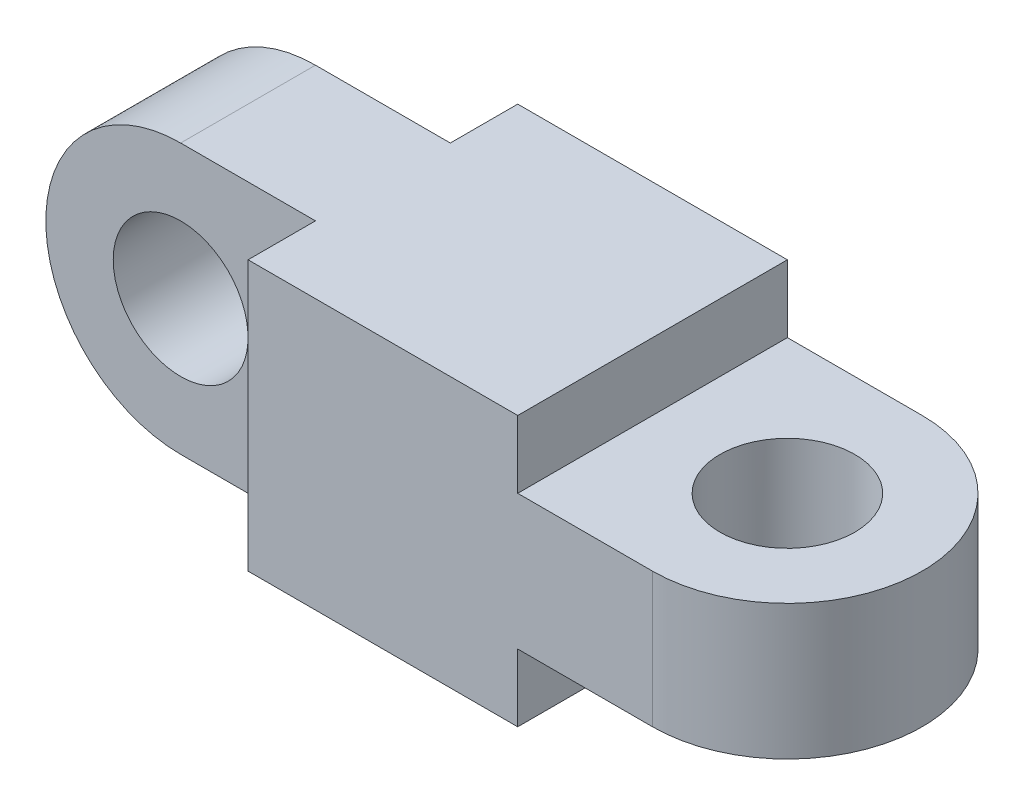
ISO-10303-21;
HEADER;
FILE_DESCRIPTION(('STEP AP214'),'2;1');
FILE_NAME('part.step','',(''),(''),'','','');
FILE_SCHEMA(('AUTOMOTIVE_DESIGN { 1 0 10303 214 1 1 1 1 }'));
ENDSEC;
DATA;
#1=APPLICATION_CONTEXT('core data for automotive mechanical design processes');
#2=APPLICATION_PROTOCOL_DEFINITION('international standard','automotive_design',2000,#1);
#3=PRODUCT_CONTEXT('',#1,'mechanical');
#4=PRODUCT('Part','Part','',(#3));
#5=PRODUCT_RELATED_PRODUCT_CATEGORY('part','',(#4));
#6=PRODUCT_DEFINITION_FORMATION('','',#4);
#7=PRODUCT_DEFINITION_CONTEXT('part definition',#1,'design');
#8=PRODUCT_DEFINITION('design','',#6,#7);
#9=PRODUCT_DEFINITION_SHAPE('','',#8);
#10=(LENGTH_UNIT() NAMED_UNIT(*) SI_UNIT(.MILLI.,.METRE.));
#11=(NAMED_UNIT(*) PLANE_ANGLE_UNIT() SI_UNIT($,.RADIAN.));
#12=(NAMED_UNIT(*) SI_UNIT($,.STERADIAN.) SOLID_ANGLE_UNIT());
#13=UNCERTAINTY_MEASURE_WITH_UNIT(LENGTH_MEASURE(1.E-05),#10,'distance_accuracy_value','');
#14=(GEOMETRIC_REPRESENTATION_CONTEXT(3) GLOBAL_UNCERTAINTY_ASSIGNED_CONTEXT((#13)) GLOBAL_UNIT_ASSIGNED_CONTEXT((#10,
#11,#12)) REPRESENTATION_CONTEXT('',''));
#15=CARTESIAN_POINT('',(0.,0.,0.));
#16=DIRECTION('',(0.,0.,1.));
#17=DIRECTION('',(1.,0.,0.));
#18=AXIS2_PLACEMENT_3D('',#15,#16,#17);
#19=CARTESIAN_POINT('',(40.,20.,10.));
#20=DIRECTION('',(0.,-1.,0.));
#21=DIRECTION('',(0.,0.,-1.));
#22=AXIS2_PLACEMENT_3D('',#19,#20,#21);
#23=PLANE('',#22);
#24=DIRECTION('',(-1.,0.,0.));
#25=VECTOR('',#24,1.);
#26=CARTESIAN_POINT('',(-10.,20.,5.));
#27=LINE('',#26,#25);
#28=CARTESIAN_POINT('',(10.,20.,5.));
#29=VERTEX_POINT('',#28);
#30=CARTESIAN_POINT('',(0.,20.,5.));
#31=VERTEX_POINT('',#30);
#32=EDGE_CURVE('E219',#29,#31,#27,.T.);
#33=ORIENTED_EDGE('',*,*,#32,.T.);
#34=DIRECTION('',(0.,0.,-1.));
#35=VECTOR('',#34,1.);
#36=CARTESIAN_POINT('',(0.,20.,20.));
#37=LINE('',#36,#35);
#38=CARTESIAN_POINT('',(0.,20.,15.));
#39=VERTEX_POINT('',#38);
#40=EDGE_CURVE('E232',#39,#31,#37,.T.);
#41=ORIENTED_EDGE('',*,*,#40,.F.);
#42=DIRECTION('',(1.,0.,0.));
#43=VECTOR('',#42,1.);
#44=CARTESIAN_POINT('',(-10.,20.,15.));
#45=LINE('',#44,#43);
#46=CARTESIAN_POINT('',(10.,20.,15.));
#47=VERTEX_POINT('',#46);
#48=EDGE_CURVE('E198',#39,#47,#45,.T.);
#49=ORIENTED_EDGE('',*,*,#48,.T.);
#50=DIRECTION('',(0.,0.,1.));
#51=VECTOR('',#50,1.);
#52=CARTESIAN_POINT('',(10.,20.,15.));
#53=LINE('',#52,#51);
#54=CARTESIAN_POINT('',(10.,20.,20.));
#55=VERTEX_POINT('',#54);
#56=EDGE_CURVE('E216',#47,#55,#53,.T.);
#57=ORIENTED_EDGE('',*,*,#56,.T.);
#58=DIRECTION('',(1.,0.,0.));
#59=VECTOR('',#58,1.);
#60=CARTESIAN_POINT('',(40.,20.,20.));
#61=LINE('',#60,#59);
#62=CARTESIAN_POINT('',(30.,20.,20.));
#63=VERTEX_POINT('',#62);
#64=EDGE_CURVE('E169',#55,#63,#61,.T.);
#65=ORIENTED_EDGE('',*,*,#64,.T.);
#66=DIRECTION('',(0.,0.,-1.));
#67=VECTOR('',#66,1.);
#68=CARTESIAN_POINT('',(30.,20.,20.));
#69=LINE('',#68,#67);
#70=CARTESIAN_POINT('',(30.,20.,0.));
#71=VERTEX_POINT('',#70);
#72=EDGE_CURVE('E54',#63,#71,#69,.T.);
#73=ORIENTED_EDGE('',*,*,#72,.T.);
#74=DIRECTION('',(-1.,0.,0.));
#75=VECTOR('',#74,1.);
#76=CARTESIAN_POINT('',(40.,20.,0.));
#77=LINE('',#76,#75);
#78=CARTESIAN_POINT('',(10.,20.,0.));
#79=VERTEX_POINT('',#78);
#80=EDGE_CURVE('E157',#71,#79,#77,.T.);
#81=ORIENTED_EDGE('',*,*,#80,.T.);
#82=DIRECTION('',(0.,0.,1.));
#83=VECTOR('',#82,1.);
#84=CARTESIAN_POINT('',(10.,20.,5.));
#85=LINE('',#84,#83);
#86=EDGE_CURVE('E160',#79,#29,#85,.T.);
#87=ORIENTED_EDGE('',*,*,#86,.T.);
#88=EDGE_LOOP('',(#33,#41,#49,#57,#65,#73,#81,#87));
#89=FACE_BOUND('',#88,.T.);
#90=ADVANCED_FACE('F38',(#89),#23,.F.);
#91=CARTESIAN_POINT('',(40.,0.,10.));
#92=DIRECTION('',(0.,-1.,0.));
#93=DIRECTION('',(0.,0.,-1.));
#94=AXIS2_PLACEMENT_3D('',#91,#92,#93);
#95=PLANE('',#94);
#96=DIRECTION('',(0.,0.,-1.));
#97=VECTOR('',#96,1.);
#98=CARTESIAN_POINT('',(0.,0.,20.));
#99=LINE('',#98,#97);
#100=CARTESIAN_POINT('',(0.,0.,15.));
#101=VERTEX_POINT('',#100);
#102=CARTESIAN_POINT('',(0.,0.,5.));
#103=VERTEX_POINT('',#102);
#104=EDGE_CURVE('E150',#101,#103,#99,.T.);
#105=ORIENTED_EDGE('',*,*,#104,.T.);
#106=DIRECTION('',(-1.,0.,0.));
#107=VECTOR('',#106,1.);
#108=CARTESIAN_POINT('',(-10.,0.,5.));
#109=LINE('',#108,#107);
#110=CARTESIAN_POINT('',(10.,0.,5.));
#111=VERTEX_POINT('',#110);
#112=EDGE_CURVE('E208',#111,#103,#109,.T.);
#113=ORIENTED_EDGE('',*,*,#112,.F.);
#114=DIRECTION('',(0.,0.,1.));
#115=VECTOR('',#114,1.);
#116=CARTESIAN_POINT('',(10.,0.,5.));
#117=LINE('',#116,#115);
#118=CARTESIAN_POINT('',(10.,0.,0.));
#119=VERTEX_POINT('',#118);
#120=EDGE_CURVE('E209',#119,#111,#117,.T.);
#121=ORIENTED_EDGE('',*,*,#120,.F.);
#122=DIRECTION('',(-1.,0.,0.));
#123=VECTOR('',#122,1.);
#124=CARTESIAN_POINT('',(40.,0.,0.));
#125=LINE('',#124,#123);
#126=CARTESIAN_POINT('',(30.,0.,0.));
#127=VERTEX_POINT('',#126);
#128=EDGE_CURVE('E149',#127,#119,#125,.T.);
#129=ORIENTED_EDGE('',*,*,#128,.F.);
#130=DIRECTION('',(0.,0.,-1.));
#131=VECTOR('',#130,1.);
#132=CARTESIAN_POINT('',(30.,0.,20.));
#133=LINE('',#132,#131);
#134=CARTESIAN_POINT('',(30.,0.,20.));
#135=VERTEX_POINT('',#134);
#136=EDGE_CURVE('E132',#135,#127,#133,.T.);
#137=ORIENTED_EDGE('',*,*,#136,.F.);
#138=DIRECTION('',(1.,0.,0.));
#139=VECTOR('',#138,1.);
#140=CARTESIAN_POINT('',(40.,0.,20.));
#141=LINE('',#140,#139);
#142=CARTESIAN_POINT('',(10.,0.,20.));
#143=VERTEX_POINT('',#142);
#144=EDGE_CURVE('E147',#143,#135,#141,.T.);
#145=ORIENTED_EDGE('',*,*,#144,.F.);
#146=DIRECTION('',(0.,0.,1.));
#147=VECTOR('',#146,1.);
#148=CARTESIAN_POINT('',(10.,0.,15.));
#149=LINE('',#148,#147);
#150=CARTESIAN_POINT('',(10.,0.,15.));
#151=VERTEX_POINT('',#150);
#152=EDGE_CURVE('E158',#151,#143,#149,.T.);
#153=ORIENTED_EDGE('',*,*,#152,.F.);
#154=DIRECTION('',(1.,0.,0.));
#155=VECTOR('',#154,1.);
#156=CARTESIAN_POINT('',(-10.,0.,15.));
#157=LINE('',#156,#155);
#158=EDGE_CURVE('E162',#101,#151,#157,.T.);
#159=ORIENTED_EDGE('',*,*,#158,.F.);
#160=EDGE_LOOP('',(#105,#113,#121,#129,#137,#145,#153,#159));
#161=FACE_BOUND('',#160,.T.);
#162=ADVANCED_FACE('F145',(#161),#95,.T.);
#163=CARTESIAN_POINT('',(40.,20.,10.));
#164=DIRECTION('',(0.,-1.,0.));
#165=DIRECTION('',(0.,0.,-1.));
#166=AXIS2_PLACEMENT_3D('',#163,#164,#165);
#167=CYLINDRICAL_SURFACE('',#166,10.);
#168=DIRECTION('',(0.,-1.,0.));
#169=VECTOR('',#168,1.);
#170=CARTESIAN_POINT('',(40.,20.,0.));
#171=LINE('',#170,#169);
#172=CARTESIAN_POINT('',(40.,15.,0.));
#173=VERTEX_POINT('',#172);
#174=CARTESIAN_POINT('',(40.,5.00000000000001,0.));
#175=VERTEX_POINT('',#174);
#176=EDGE_CURVE('E180',#173,#175,#171,.T.);
#177=ORIENTED_EDGE('',*,*,#176,.F.);
#178=CARTESIAN_POINT('',(40.,15.,10.));
#179=DIRECTION('',(0.,-1.,0.));
#180=DIRECTION('',(1.,0.,0.));
#181=AXIS2_PLACEMENT_3D('',#178,#179,#180);
#182=CIRCLE('',#181,10.);
#183=CARTESIAN_POINT('',(40.,15.,20.));
#184=VERTEX_POINT('',#183);
#185=EDGE_CURVE('E206',#173,#184,#182,.T.);
#186=ORIENTED_EDGE('',*,*,#185,.T.);
#187=DIRECTION('',(0.,-1.,0.));
#188=VECTOR('',#187,1.);
#189=CARTESIAN_POINT('',(40.,20.,20.));
#190=LINE('',#189,#188);
#191=CARTESIAN_POINT('',(40.,5.,20.));
#192=VERTEX_POINT('',#191);
#193=EDGE_CURVE('E166',#184,#192,#190,.T.);
#194=ORIENTED_EDGE('',*,*,#193,.T.);
#195=CARTESIAN_POINT('',(40.,5.00000000000001,10.));
#196=DIRECTION('',(0.,1.,0.));
#197=DIRECTION('',(-1.,0.,0.));
#198=AXIS2_PLACEMENT_3D('',#195,#196,#197);
#199=CIRCLE('',#198,10.);
#200=EDGE_CURVE('E62',#192,#175,#199,.T.);
#201=ORIENTED_EDGE('',*,*,#200,.T.);
#202=EDGE_LOOP('',(#177,#186,#194,#201));
#203=FACE_BOUND('',#202,.T.);
#204=ADVANCED_FACE('F40',(#203),#167,.T.);
#205=CARTESIAN_POINT('',(40.,20.,0.));
#206=DIRECTION('',(0.,0.,1.));
#207=DIRECTION('',(1.,0.,0.));
#208=AXIS2_PLACEMENT_3D('',#205,#206,#207);
#209=PLANE('',#208);
#210=DIRECTION('',(1.,0.,0.));
#211=VECTOR('',#210,1.);
#212=CARTESIAN_POINT('',(50.,5.00000000000001,0.));
#213=LINE('',#212,#211);
#214=CARTESIAN_POINT('',(30.,5.00000000000001,0.));
#215=VERTEX_POINT('',#214);
#216=EDGE_CURVE('E238',#215,#175,#213,.T.);
#217=ORIENTED_EDGE('',*,*,#216,.F.);
#218=DIRECTION('',(0.,1.,0.));
#219=VECTOR('',#218,1.);
#220=CARTESIAN_POINT('',(30.,5.00000000000001,0.));
#221=LINE('',#220,#219);
#222=EDGE_CURVE('E240',#127,#215,#221,.T.);
#223=ORIENTED_EDGE('',*,*,#222,.F.);
#224=ORIENTED_EDGE('',*,*,#128,.T.);
#225=DIRECTION('',(0.,-1.,0.));
#226=VECTOR('',#225,1.);
#227=CARTESIAN_POINT('',(10.,20.,0.));
#228=LINE('',#227,#226);
#229=EDGE_CURVE('E177',#79,#119,#228,.T.);
#230=ORIENTED_EDGE('',*,*,#229,.F.);
#231=ORIENTED_EDGE('',*,*,#80,.F.);
#232=DIRECTION('',(0.,1.,0.));
#233=VECTOR('',#232,1.);
#234=CARTESIAN_POINT('',(30.,15.,0.));
#235=LINE('',#234,#233);
#236=CARTESIAN_POINT('',(30.,15.,0.));
#237=VERTEX_POINT('',#236);
#238=EDGE_CURVE('E139',#237,#71,#235,.T.);
#239=ORIENTED_EDGE('',*,*,#238,.F.);
#240=DIRECTION('',(-1.,0.,0.));
#241=VECTOR('',#240,1.);
#242=CARTESIAN_POINT('',(50.,15.,0.));
#243=LINE('',#242,#241);
#244=EDGE_CURVE('E236',#173,#237,#243,.T.);
#245=ORIENTED_EDGE('',*,*,#244,.F.);
#246=ORIENTED_EDGE('',*,*,#176,.T.);
#247=EDGE_LOOP('',(#217,#223,#224,#230,#231,#239,#245,#246));
#248=FACE_BOUND('',#247,.T.);
#249=ADVANCED_FACE('F255',(#248),#209,.F.);
#250=CARTESIAN_POINT('',(-10.,20.,5.));
#251=DIRECTION('',(0.,0.,1.));
#252=DIRECTION('',(1.,0.,0.));
#253=AXIS2_PLACEMENT_3D('',#250,#251,#252);
#254=PLANE('',#253);
#255=CARTESIAN_POINT('',(0.,10.,5.));
#256=DIRECTION('',(0.,0.,1.));
#257=DIRECTION('',(1.,0.,0.));
#258=AXIS2_PLACEMENT_3D('',#255,#256,#257);
#259=CIRCLE('',#258,5.);
#260=CARTESIAN_POINT('',(5.,10.,5.));
#261=VERTEX_POINT('',#260);
#262=EDGE_CURVE('E11',#261,#261,#259,.F.);
#263=ORIENTED_EDGE('',*,*,#262,.F.);
#264=EDGE_LOOP('',(#263));
#265=FACE_BOUND('',#264,.T.);
#266=ORIENTED_EDGE('',*,*,#112,.T.);
#267=CARTESIAN_POINT('',(0.,10.,5.));
#268=DIRECTION('',(0.,0.,1.));
#269=DIRECTION('',(1.,0.,0.));
#270=AXIS2_PLACEMENT_3D('',#267,#268,#269);
#271=CIRCLE('',#270,10.);
#272=EDGE_CURVE('E203',#103,#31,#271,.F.);
#273=ORIENTED_EDGE('',*,*,#272,.T.);
#274=ORIENTED_EDGE('',*,*,#32,.F.);
#275=DIRECTION('',(0.,-1.,0.));
#276=VECTOR('',#275,1.);
#277=CARTESIAN_POINT('',(10.,20.,5.));
#278=LINE('',#277,#276);
#279=EDGE_CURVE('E174',#29,#111,#278,.T.);
#280=ORIENTED_EDGE('',*,*,#279,.T.);
#281=EDGE_LOOP('',(#266,#273,#274,#280));
#282=FACE_BOUND('',#281,.T.);
#283=ADVANCED_FACE('F289',(#265,#282),#254,.F.);
#284=CARTESIAN_POINT('',(-10.,20.,15.));
#285=DIRECTION('',(0.,0.,-1.));
#286=DIRECTION('',(-1.,0.,0.));
#287=AXIS2_PLACEMENT_3D('',#284,#285,#286);
#288=PLANE('',#287);
#289=CARTESIAN_POINT('',(0.,10.,15.));
#290=DIRECTION('',(0.,0.,-1.));
#291=DIRECTION('',(-1.,0.,0.));
#292=AXIS2_PLACEMENT_3D('',#289,#290,#291);
#293=CIRCLE('',#292,5.);
#294=CARTESIAN_POINT('',(-5.,10.,15.));
#295=VERTEX_POINT('',#294);
#296=EDGE_CURVE('E188',#295,#295,#293,.F.);
#297=ORIENTED_EDGE('',*,*,#296,.F.);
#298=EDGE_LOOP('',(#297));
#299=FACE_BOUND('',#298,.T.);
#300=CARTESIAN_POINT('',(0.,10.,15.));
#301=DIRECTION('',(0.,0.,-1.));
#302=DIRECTION('',(-1.,0.,0.));
#303=AXIS2_PLACEMENT_3D('',#300,#301,#302);
#304=CIRCLE('',#303,10.);
#305=EDGE_CURVE('E42',#39,#101,#304,.F.);
#306=ORIENTED_EDGE('',*,*,#305,.T.);
#307=ORIENTED_EDGE('',*,*,#158,.T.);
#308=DIRECTION('',(0.,-1.,0.));
#309=VECTOR('',#308,1.);
#310=CARTESIAN_POINT('',(10.,20.,15.));
#311=LINE('',#310,#309);
#312=EDGE_CURVE('E171',#47,#151,#311,.T.);
#313=ORIENTED_EDGE('',*,*,#312,.F.);
#314=ORIENTED_EDGE('',*,*,#48,.F.);
#315=EDGE_LOOP('',(#306,#307,#313,#314));
#316=FACE_BOUND('',#315,.T.);
#317=ADVANCED_FACE('F195',(#299,#316),#288,.F.);
#318=CARTESIAN_POINT('',(40.,20.,20.));
#319=DIRECTION('',(0.,0.,-1.));
#320=DIRECTION('',(-1.,0.,0.));
#321=AXIS2_PLACEMENT_3D('',#318,#319,#320);
#322=PLANE('',#321);
#323=ORIENTED_EDGE('',*,*,#144,.T.);
#324=DIRECTION('',(0.,1.,0.));
#325=VECTOR('',#324,1.);
#326=CARTESIAN_POINT('',(30.,5.00000000000001,20.));
#327=LINE('',#326,#325);
#328=CARTESIAN_POINT('',(30.,5.00000000000001,20.));
#329=VERTEX_POINT('',#328);
#330=EDGE_CURVE('E129',#135,#329,#327,.T.);
#331=ORIENTED_EDGE('',*,*,#330,.T.);
#332=DIRECTION('',(1.,0.,0.));
#333=VECTOR('',#332,1.);
#334=CARTESIAN_POINT('',(50.,5.00000000000001,20.));
#335=LINE('',#334,#333);
#336=EDGE_CURVE('E138',#329,#192,#335,.T.);
#337=ORIENTED_EDGE('',*,*,#336,.T.);
#338=ORIENTED_EDGE('',*,*,#193,.F.);
#339=DIRECTION('',(-1.,0.,0.));
#340=VECTOR('',#339,1.);
#341=CARTESIAN_POINT('',(50.,15.,20.));
#342=LINE('',#341,#340);
#343=CARTESIAN_POINT('',(30.,15.,20.));
#344=VERTEX_POINT('',#343);
#345=EDGE_CURVE('E243',#184,#344,#342,.T.);
#346=ORIENTED_EDGE('',*,*,#345,.T.);
#347=DIRECTION('',(0.,1.,0.));
#348=VECTOR('',#347,1.);
#349=CARTESIAN_POINT('',(30.,15.,20.));
#350=LINE('',#349,#348);
#351=EDGE_CURVE('E234',#344,#63,#350,.T.);
#352=ORIENTED_EDGE('',*,*,#351,.T.);
#353=ORIENTED_EDGE('',*,*,#64,.F.);
#354=DIRECTION('',(0.,-1.,0.));
#355=VECTOR('',#354,1.);
#356=CARTESIAN_POINT('',(10.,20.,20.));
#357=LINE('',#356,#355);
#358=EDGE_CURVE('E156',#55,#143,#357,.T.);
#359=ORIENTED_EDGE('',*,*,#358,.T.);
#360=EDGE_LOOP('',(#323,#331,#337,#338,#346,#352,#353,#359));
#361=FACE_BOUND('',#360,.T.);
#362=ADVANCED_FACE('F153',(#361),#322,.F.);
#363=CARTESIAN_POINT('',(10.,20.,5.));
#364=DIRECTION('',(1.,0.,0.));
#365=DIRECTION('',(0.,0.,-1.));
#366=AXIS2_PLACEMENT_3D('',#363,#364,#365);
#367=PLANE('',#366);
#368=ORIENTED_EDGE('',*,*,#120,.T.);
#369=ORIENTED_EDGE('',*,*,#279,.F.);
#370=ORIENTED_EDGE('',*,*,#86,.F.);
#371=ORIENTED_EDGE('',*,*,#229,.T.);
#372=EDGE_LOOP('',(#368,#369,#370,#371));
#373=FACE_BOUND('',#372,.T.);
#374=ADVANCED_FACE('F264',(#373),#367,.F.);
#375=CARTESIAN_POINT('',(10.,20.,15.));
#376=DIRECTION('',(1.,0.,0.));
#377=DIRECTION('',(0.,0.,-1.));
#378=AXIS2_PLACEMENT_3D('',#375,#376,#377);
#379=PLANE('',#378);
#380=ORIENTED_EDGE('',*,*,#152,.T.);
#381=ORIENTED_EDGE('',*,*,#358,.F.);
#382=ORIENTED_EDGE('',*,*,#56,.F.);
#383=ORIENTED_EDGE('',*,*,#312,.T.);
#384=EDGE_LOOP('',(#380,#381,#382,#383));
#385=FACE_BOUND('',#384,.T.);
#386=ADVANCED_FACE('F262',(#385),#379,.F.);
#387=CARTESIAN_POINT('',(50.,15.,20.));
#388=DIRECTION('',(0.,-1.,0.));
#389=DIRECTION('',(1.,0.,0.));
#390=AXIS2_PLACEMENT_3D('',#387,#388,#389);
#391=PLANE('',#390);
#392=CARTESIAN_POINT('',(40.,15.,10.));
#393=DIRECTION('',(0.,-1.,0.));
#394=DIRECTION('',(1.,0.,0.));
#395=AXIS2_PLACEMENT_3D('',#392,#393,#394);
#396=CIRCLE('',#395,5.00000000000001);
#397=CARTESIAN_POINT('',(45.,15.,10.));
#398=VERTEX_POINT('',#397);
#399=EDGE_CURVE('E183',#398,#398,#396,.T.);
#400=ORIENTED_EDGE('',*,*,#399,.T.);
#401=EDGE_LOOP('',(#400));
#402=FACE_BOUND('',#401,.T.);
#403=ORIENTED_EDGE('',*,*,#185,.F.);
#404=ORIENTED_EDGE('',*,*,#244,.T.);
#405=DIRECTION('',(0.,0.,-1.));
#406=VECTOR('',#405,1.);
#407=CARTESIAN_POINT('',(30.,15.,20.));
#408=LINE('',#407,#406);
#409=EDGE_CURVE('E228',#344,#237,#408,.T.);
#410=ORIENTED_EDGE('',*,*,#409,.F.);
#411=ORIENTED_EDGE('',*,*,#345,.F.);
#412=EDGE_LOOP('',(#403,#404,#410,#411));
#413=FACE_BOUND('',#412,.T.);
#414=ADVANCED_FACE('F251',(#402,#413),#391,.F.);
#415=CARTESIAN_POINT('',(30.,15.,20.));
#416=DIRECTION('',(-1.,0.,0.));
#417=DIRECTION('',(0.,-1.,0.));
#418=AXIS2_PLACEMENT_3D('',#415,#416,#417);
#419=PLANE('',#418);
#420=ORIENTED_EDGE('',*,*,#238,.T.);
#421=ORIENTED_EDGE('',*,*,#72,.F.);
#422=ORIENTED_EDGE('',*,*,#351,.F.);
#423=ORIENTED_EDGE('',*,*,#409,.T.);
#424=EDGE_LOOP('',(#420,#421,#422,#423));
#425=FACE_BOUND('',#424,.T.);
#426=ADVANCED_FACE('F258',(#425),#419,.F.);
#427=CARTESIAN_POINT('',(40.,20.,10.));
#428=DIRECTION('',(0.,-1.,0.));
#429=DIRECTION('',(0.,0.,-1.));
#430=AXIS2_PLACEMENT_3D('',#427,#428,#429);
#431=CYLINDRICAL_SURFACE('',#430,5.00000000000001);
#432=ORIENTED_EDGE('',*,*,#399,.F.);
#433=EDGE_LOOP('',(#432));
#434=FACE_BOUND('',#433,.T.);
#435=CARTESIAN_POINT('',(40.,5.00000000000001,10.));
#436=DIRECTION('',(0.,1.,0.));
#437=DIRECTION('',(-1.,0.,0.));
#438=AXIS2_PLACEMENT_3D('',#435,#436,#437);
#439=CIRCLE('',#438,5.00000000000001);
#440=CARTESIAN_POINT('',(35.,5.00000000000001,10.));
#441=VERTEX_POINT('',#440);
#442=EDGE_CURVE('E186',#441,#441,#439,.T.);
#443=ORIENTED_EDGE('',*,*,#442,.F.);
#444=EDGE_LOOP('',(#443));
#445=FACE_BOUND('',#444,.T.);
#446=ADVANCED_FACE('F283',(#434,#445),#431,.F.);
#447=CARTESIAN_POINT('',(50.,5.00000000000001,20.));
#448=DIRECTION('',(0.,1.,0.));
#449=DIRECTION('',(-1.,0.,0.));
#450=AXIS2_PLACEMENT_3D('',#447,#448,#449);
#451=PLANE('',#450);
#452=ORIENTED_EDGE('',*,*,#442,.T.);
#453=EDGE_LOOP('',(#452));
#454=FACE_BOUND('',#453,.T.);
#455=ORIENTED_EDGE('',*,*,#200,.F.);
#456=ORIENTED_EDGE('',*,*,#336,.F.);
#457=DIRECTION('',(0.,0.,-1.));
#458=VECTOR('',#457,1.);
#459=CARTESIAN_POINT('',(30.,5.00000000000001,20.));
#460=LINE('',#459,#458);
#461=EDGE_CURVE('E135',#329,#215,#460,.T.);
#462=ORIENTED_EDGE('',*,*,#461,.T.);
#463=ORIENTED_EDGE('',*,*,#216,.T.);
#464=EDGE_LOOP('',(#455,#456,#462,#463));
#465=FACE_BOUND('',#464,.T.);
#466=ADVANCED_FACE('F344',(#454,#465),#451,.F.);
#467=CARTESIAN_POINT('',(30.,5.00000000000001,20.));
#468=DIRECTION('',(-1.,0.,0.));
#469=DIRECTION('',(0.,0.,1.));
#470=AXIS2_PLACEMENT_3D('',#467,#468,#469);
#471=PLANE('',#470);
#472=ORIENTED_EDGE('',*,*,#222,.T.);
#473=ORIENTED_EDGE('',*,*,#461,.F.);
#474=ORIENTED_EDGE('',*,*,#330,.F.);
#475=ORIENTED_EDGE('',*,*,#136,.T.);
#476=EDGE_LOOP('',(#472,#473,#474,#475));
#477=FACE_BOUND('',#476,.T.);
#478=ADVANCED_FACE('F131',(#477),#471,.F.);
#479=CARTESIAN_POINT('',(0.,10.,20.));
#480=DIRECTION('',(0.,0.,-1.));
#481=DIRECTION('',(-1.,0.,0.));
#482=AXIS2_PLACEMENT_3D('',#479,#480,#481);
#483=CYLINDRICAL_SURFACE('',#482,5.);
#484=ORIENTED_EDGE('',*,*,#296,.T.);
#485=EDGE_LOOP('',(#484));
#486=FACE_BOUND('',#485,.T.);
#487=ORIENTED_EDGE('',*,*,#262,.T.);
#488=EDGE_LOOP('',(#487));
#489=FACE_BOUND('',#488,.T.);
#490=ADVANCED_FACE('F362',(#486,#489),#483,.F.);
#491=CARTESIAN_POINT('',(0.,10.,20.));
#492=DIRECTION('',(0.,0.,-1.));
#493=DIRECTION('',(-1.,0.,0.));
#494=AXIS2_PLACEMENT_3D('',#491,#492,#493);
#495=CYLINDRICAL_SURFACE('',#494,10.);
#496=ORIENTED_EDGE('',*,*,#272,.F.);
#497=ORIENTED_EDGE('',*,*,#104,.F.);
#498=ORIENTED_EDGE('',*,*,#305,.F.);
#499=ORIENTED_EDGE('',*,*,#40,.T.);
#500=EDGE_LOOP('',(#496,#497,#498,#499));
#501=FACE_BOUND('',#500,.T.);
#502=ADVANCED_FACE('F202',(#501),#495,.T.);
#503=CLOSED_SHELL('',(#90,#162,#204,#249,#283,#317,#362,#374,#386,#414,#426,#446,#466,#478,#490,#502));
#504=MANIFOLD_SOLID_BREP('B2',#503);
#505=ADVANCED_BREP_SHAPE_REPRESENTATION('',(#18,#504),#14);
#506=SHAPE_DEFINITION_REPRESENTATION(#9,#505);
ENDSEC;
END-ISO-10303-21;
